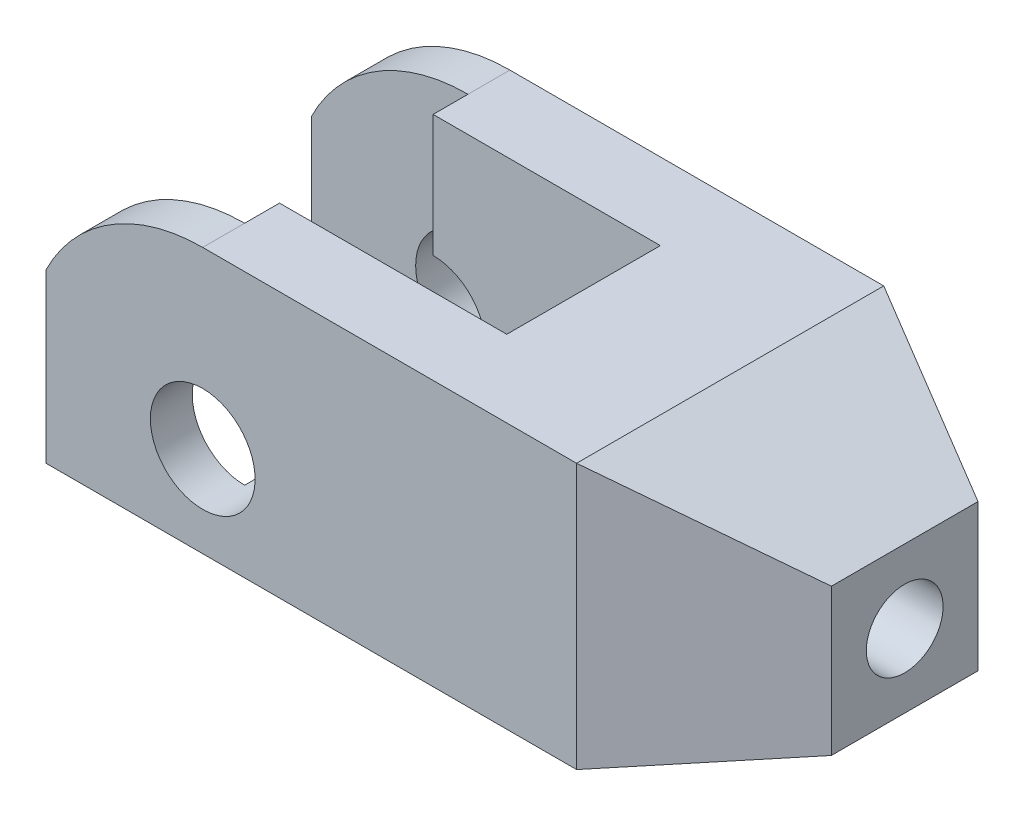
ISO-10303-21;
HEADER;
FILE_DESCRIPTION(('STEP AP214'),'2;1');
FILE_NAME('part.step','',(''),(''),'','','');
FILE_SCHEMA(('AUTOMOTIVE_DESIGN { 1 0 10303 214 1 1 1 1 }'));
ENDSEC;
DATA;
#1=APPLICATION_CONTEXT('core data for automotive mechanical design processes');
#2=APPLICATION_PROTOCOL_DEFINITION('international standard','automotive_design',2000,#1);
#3=PRODUCT_CONTEXT('',#1,'mechanical');
#4=PRODUCT('Part','Part','',(#3));
#5=PRODUCT_RELATED_PRODUCT_CATEGORY('part','',(#4));
#6=PRODUCT_DEFINITION_FORMATION('','',#4);
#7=PRODUCT_DEFINITION_CONTEXT('part definition',#1,'design');
#8=PRODUCT_DEFINITION('design','',#6,#7);
#9=PRODUCT_DEFINITION_SHAPE('','',#8);
#10=(LENGTH_UNIT() NAMED_UNIT(*) SI_UNIT(.MILLI.,.METRE.));
#11=(NAMED_UNIT(*) PLANE_ANGLE_UNIT() SI_UNIT($,.RADIAN.));
#12=(NAMED_UNIT(*) SI_UNIT($,.STERADIAN.) SOLID_ANGLE_UNIT());
#13=UNCERTAINTY_MEASURE_WITH_UNIT(LENGTH_MEASURE(1.E-05),#10,'distance_accuracy_value','');
#14=(GEOMETRIC_REPRESENTATION_CONTEXT(3) GLOBAL_UNCERTAINTY_ASSIGNED_CONTEXT((#13)) GLOBAL_UNIT_ASSIGNED_CONTEXT((#10,
#11,#12)) REPRESENTATION_CONTEXT('',''));
#15=CARTESIAN_POINT('',(0.,0.,0.));
#16=DIRECTION('',(0.,0.,1.));
#17=DIRECTION('',(1.,0.,0.));
#18=AXIS2_PLACEMENT_3D('',#15,#16,#17);
#19=CARTESIAN_POINT('',(0.,38.,0.));
#20=DIRECTION('',(0.,-1.,0.));
#21=DIRECTION('',(0.,0.,-1.));
#22=AXIS2_PLACEMENT_3D('',#19,#20,#21);
#23=PLANE('',#22);
#24=DIRECTION('',(-1.,0.,0.));
#25=VECTOR('',#24,1.);
#26=CARTESIAN_POINT('',(0.,38.,-11.));
#27=LINE('',#26,#25);
#28=CARTESIAN_POINT('',(17.,38.,-11.));
#29=VERTEX_POINT('',#28);
#30=CARTESIAN_POINT('',(-15.5500556793563,38.,-11.));
#31=VERTEX_POINT('',#30);
#32=EDGE_CURVE('E323',#29,#31,#27,.T.);
#33=ORIENTED_EDGE('',*,*,#32,.F.);
#34=DIRECTION('',(0.,0.,-1.));
#35=VECTOR('',#34,1.);
#36=CARTESIAN_POINT('',(17.,38.,0.));
#37=LINE('',#36,#35);
#38=CARTESIAN_POINT('',(17.,38.,11.));
#39=VERTEX_POINT('',#38);
#40=EDGE_CURVE('E307',#39,#29,#37,.T.);
#41=ORIENTED_EDGE('',*,*,#40,.F.);
#42=DIRECTION('',(-1.,0.,0.));
#43=VECTOR('',#42,1.);
#44=CARTESIAN_POINT('',(0.,38.,11.));
#45=LINE('',#44,#43);
#46=CARTESIAN_POINT('',(-15.5500556793563,38.,11.));
#47=VERTEX_POINT('',#46);
#48=EDGE_CURVE('E326',#39,#47,#45,.T.);
#49=ORIENTED_EDGE('',*,*,#48,.T.);
#50=DIRECTION('',(0.,0.,1.));
#51=VECTOR('',#50,1.);
#52=CARTESIAN_POINT('',(-15.5500556793563,38.,-22.));
#53=LINE('',#52,#51);
#54=CARTESIAN_POINT('',(-15.5500556793563,38.,16.));
#55=VERTEX_POINT('',#54);
#56=EDGE_CURVE('E310',#55,#47,#53,.F.);
#57=ORIENTED_EDGE('',*,*,#56,.F.);
#58=DIRECTION('',(0.,0.,1.));
#59=VECTOR('',#58,1.);
#60=CARTESIAN_POINT('',(-15.5500556793563,38.,-22.));
#61=LINE('',#60,#59);
#62=CARTESIAN_POINT('',(-15.5500556793563,38.,22.));
#63=VERTEX_POINT('',#62);
#64=EDGE_CURVE('E299',#55,#63,#61,.T.);
#65=ORIENTED_EDGE('',*,*,#64,.T.);
#66=DIRECTION('',(1.,0.,0.));
#67=VECTOR('',#66,1.);
#68=CARTESIAN_POINT('',(-38.,38.,22.));
#69=LINE('',#68,#67);
#70=CARTESIAN_POINT('',(38.,38.,22.));
#71=VERTEX_POINT('',#70);
#72=EDGE_CURVE('E249',#63,#71,#69,.T.);
#73=ORIENTED_EDGE('',*,*,#72,.T.);
#74=DIRECTION('',(0.,0.,-1.));
#75=VECTOR('',#74,1.);
#76=CARTESIAN_POINT('',(38.,38.,0.));
#77=LINE('',#76,#75);
#78=CARTESIAN_POINT('',(38.,38.,-22.));
#79=VERTEX_POINT('',#78);
#80=EDGE_CURVE('E247',#71,#79,#77,.T.);
#81=ORIENTED_EDGE('',*,*,#80,.T.);
#82=DIRECTION('',(-1.,0.,0.));
#83=VECTOR('',#82,1.);
#84=CARTESIAN_POINT('',(-38.,38.,-22.));
#85=LINE('',#84,#83);
#86=CARTESIAN_POINT('',(-15.5500556793563,38.,-22.));
#87=VERTEX_POINT('',#86);
#88=EDGE_CURVE('E253',#79,#87,#85,.T.);
#89=ORIENTED_EDGE('',*,*,#88,.T.);
#90=CARTESIAN_POINT('',(-15.5500556793563,38.,-16.));
#91=VERTEX_POINT('',#90);
#92=EDGE_CURVE('E294',#87,#91,#61,.T.);
#93=ORIENTED_EDGE('',*,*,#92,.T.);
#94=DIRECTION('',(0.,0.,1.));
#95=VECTOR('',#94,1.);
#96=CARTESIAN_POINT('',(-15.5500556793563,38.,-22.));
#97=LINE('',#96,#95);
#98=EDGE_CURVE('E320',#31,#91,#97,.F.);
#99=ORIENTED_EDGE('',*,*,#98,.F.);
#100=EDGE_LOOP('',(#33,#41,#49,#57,#65,#73,#81,#89,#93,#99));
#101=FACE_BOUND('',#100,.T.);
#102=ADVANCED_FACE('F51',(#101),#23,.F.);
#103=CARTESIAN_POINT('',(-38.,38.,22.));
#104=DIRECTION('',(1.,0.,0.));
#105=DIRECTION('',(0.,0.,-1.));
#106=AXIS2_PLACEMENT_3D('',#103,#104,#105);
#107=PLANE('',#106);
#108=DIRECTION('',(0.,1.,0.));
#109=VECTOR('',#108,1.);
#110=CARTESIAN_POINT('',(-38.,0.,-16.));
#111=LINE('',#110,#109);
#112=CARTESIAN_POINT('',(-38.,0.,-16.));
#113=VERTEX_POINT('',#112);
#114=CARTESIAN_POINT('',(-38.,24.,-16.));
#115=VERTEX_POINT('',#114);
#116=EDGE_CURVE('E346',#113,#115,#111,.T.);
#117=ORIENTED_EDGE('',*,*,#116,.T.);
#118=DIRECTION('',(0.,0.,1.));
#119=VECTOR('',#118,1.);
#120=CARTESIAN_POINT('',(-38.,24.,-22.));
#121=LINE('',#120,#119);
#122=CARTESIAN_POINT('',(-38.,24.,-22.));
#123=VERTEX_POINT('',#122);
#124=EDGE_CURVE('E295',#123,#115,#121,.T.);
#125=ORIENTED_EDGE('',*,*,#124,.F.);
#126=DIRECTION('',(0.,-1.,0.));
#127=VECTOR('',#126,1.);
#128=CARTESIAN_POINT('',(-38.,38.,-22.));
#129=LINE('',#128,#127);
#130=CARTESIAN_POINT('',(-38.,0.,-22.));
#131=VERTEX_POINT('',#130);
#132=EDGE_CURVE('E228',#123,#131,#129,.T.);
#133=ORIENTED_EDGE('',*,*,#132,.T.);
#134=DIRECTION('',(0.,0.,1.));
#135=VECTOR('',#134,1.);
#136=CARTESIAN_POINT('',(-38.,0.,22.));
#137=LINE('',#136,#135);
#138=EDGE_CURVE('E248',#131,#113,#137,.T.);
#139=ORIENTED_EDGE('',*,*,#138,.T.);
#140=EDGE_LOOP('',(#117,#125,#133,#139));
#141=FACE_BOUND('',#140,.T.);
#142=ADVANCED_FACE('F530',(#141),#107,.F.);
#143=CARTESIAN_POINT('',(-15.5500556793563,13.,-22.));
#144=DIRECTION('',(0.,0.,1.));
#145=DIRECTION('',(1.,0.,0.));
#146=AXIS2_PLACEMENT_3D('',#143,#144,#145);
#147=CYLINDRICAL_SURFACE('',#146,25.);
#148=CARTESIAN_POINT('',(-15.5500556793563,13.,-16.));
#149=DIRECTION('',(0.,0.,1.));
#150=DIRECTION('',(1.,0.,0.));
#151=AXIS2_PLACEMENT_3D('',#148,#149,#150);
#152=CIRCLE('',#151,25.);
#153=EDGE_CURVE('E317',#91,#115,#152,.T.);
#154=ORIENTED_EDGE('',*,*,#153,.F.);
#155=ORIENTED_EDGE('',*,*,#92,.F.);
#156=CARTESIAN_POINT('',(-15.5500556793563,13.,-22.));
#157=DIRECTION('',(0.,0.,-1.));
#158=DIRECTION('',(1.,0.,0.));
#159=AXIS2_PLACEMENT_3D('',#156,#157,#158);
#160=CIRCLE('',#159,25.);
#161=EDGE_CURVE('E290',#123,#87,#160,.T.);
#162=ORIENTED_EDGE('',*,*,#161,.F.);
#163=ORIENTED_EDGE('',*,*,#124,.T.);
#164=EDGE_LOOP('',(#154,#155,#162,#163));
#165=FACE_BOUND('',#164,.T.);
#166=ADVANCED_FACE('F536',(#165),#147,.T.);
#167=CARTESIAN_POINT('',(-15.5500556793563,13.,-22.));
#168=DIRECTION('',(0.,0.,1.));
#169=DIRECTION('',(1.,0.,0.));
#170=AXIS2_PLACEMENT_3D('',#167,#168,#169);
#171=CYLINDRICAL_SURFACE('',#170,7.5);
#172=CARTESIAN_POINT('',(-15.5500556793563,13.,-22.));
#173=DIRECTION('',(0.,0.,1.));
#174=DIRECTION('',(1.,0.,0.));
#175=AXIS2_PLACEMENT_3D('',#172,#173,#174);
#176=CIRCLE('',#175,7.5);
#177=CARTESIAN_POINT('',(-8.05005567935635,13.,-22.));
#178=VERTEX_POINT('',#177);
#179=EDGE_CURVE('E280',#178,#178,#176,.T.);
#180=ORIENTED_EDGE('',*,*,#179,.F.);
#181=EDGE_LOOP('',(#180));
#182=FACE_BOUND('',#181,.T.);
#183=CARTESIAN_POINT('',(-15.5500556793563,13.,-16.));
#184=DIRECTION('',(0.,0.,1.));
#185=DIRECTION('',(1.,0.,0.));
#186=AXIS2_PLACEMENT_3D('',#183,#184,#185);
#187=CIRCLE('',#186,7.5);
#188=CARTESIAN_POINT('',(-15.5500556793563,5.5,-16.));
#189=VERTEX_POINT('',#188);
#190=CARTESIAN_POINT('',(-15.5500556793563,20.5,-16.));
#191=VERTEX_POINT('',#190);
#192=EDGE_CURVE('E12',#189,#191,#187,.F.);
#193=ORIENTED_EDGE('',*,*,#192,.F.);
#194=DIRECTION('',(0.,0.,1.));
#195=VECTOR('',#194,1.);
#196=CARTESIAN_POINT('',(-15.5500556793563,5.5,-22.));
#197=LINE('',#196,#195);
#198=CARTESIAN_POINT('',(-15.5500556793563,5.5,-11.));
#199=VERTEX_POINT('',#198);
#200=EDGE_CURVE('E62',#199,#189,#197,.F.);
#201=ORIENTED_EDGE('',*,*,#200,.F.);
#202=CARTESIAN_POINT('',(-15.5500556793563,13.,-11.));
#203=DIRECTION('',(0.,0.,1.));
#204=DIRECTION('',(1.,0.,0.));
#205=AXIS2_PLACEMENT_3D('',#202,#203,#204);
#206=CIRCLE('',#205,7.5);
#207=CARTESIAN_POINT('',(-15.5500556793563,20.5,-11.));
#208=VERTEX_POINT('',#207);
#209=EDGE_CURVE('E236',#208,#199,#206,.F.);
#210=ORIENTED_EDGE('',*,*,#209,.F.);
#211=DIRECTION('',(0.,0.,1.));
#212=VECTOR('',#211,1.);
#213=CARTESIAN_POINT('',(-15.5500556793563,20.5,-22.));
#214=LINE('',#213,#212);
#215=EDGE_CURVE('E239',#191,#208,#214,.T.);
#216=ORIENTED_EDGE('',*,*,#215,.F.);
#217=EDGE_LOOP('',(#193,#201,#210,#216));
#218=FACE_BOUND('',#217,.T.);
#219=ADVANCED_FACE('F554',(#182,#218),#171,.F.);
#220=CARTESIAN_POINT('',(-38.,38.,-22.));
#221=DIRECTION('',(0.,0.,1.));
#222=DIRECTION('',(1.,0.,0.));
#223=AXIS2_PLACEMENT_3D('',#220,#221,#222);
#224=PLANE('',#223);
#225=ORIENTED_EDGE('',*,*,#179,.T.);
#226=EDGE_LOOP('',(#225));
#227=FACE_BOUND('',#226,.T.);
#228=ORIENTED_EDGE('',*,*,#132,.F.);
#229=ORIENTED_EDGE('',*,*,#161,.T.);
#230=ORIENTED_EDGE('',*,*,#88,.F.);
#231=DIRECTION('',(0.,1.,0.));
#232=VECTOR('',#231,1.);
#233=CARTESIAN_POINT('',(38.,38.,-22.));
#234=LINE('',#233,#232);
#235=CARTESIAN_POINT('',(38.,0.,-22.));
#236=VERTEX_POINT('',#235);
#237=EDGE_CURVE('E222',#79,#236,#234,.F.);
#238=ORIENTED_EDGE('',*,*,#237,.T.);
#239=DIRECTION('',(-1.,0.,0.));
#240=VECTOR('',#239,1.);
#241=CARTESIAN_POINT('',(-38.,0.,-22.));
#242=LINE('',#241,#240);
#243=EDGE_CURVE('E257',#236,#131,#242,.T.);
#244=ORIENTED_EDGE('',*,*,#243,.T.);
#245=EDGE_LOOP('',(#228,#229,#230,#238,#244));
#246=FACE_BOUND('',#245,.T.);
#247=ADVANCED_FACE('F53',(#227,#246),#224,.F.);
#248=CARTESIAN_POINT('',(-38.,24.,16.));
#249=VERTEX_POINT('',#248);
#250=CARTESIAN_POINT('',(-38.,24.,22.));
#251=VERTEX_POINT('',#250);
#252=EDGE_CURVE('E300',#249,#251,#121,.T.);
#253=ORIENTED_EDGE('',*,*,#252,.F.);
#254=DIRECTION('',(0.,1.,0.));
#255=VECTOR('',#254,1.);
#256=CARTESIAN_POINT('',(-38.,0.,16.));
#257=LINE('',#256,#255);
#258=CARTESIAN_POINT('',(-38.,0.,16.));
#259=VERTEX_POINT('',#258);
#260=EDGE_CURVE('E350',#259,#249,#257,.T.);
#261=ORIENTED_EDGE('',*,*,#260,.F.);
#262=CARTESIAN_POINT('',(-38.,0.,22.));
#263=VERTEX_POINT('',#262);
#264=EDGE_CURVE('E261',#259,#263,#137,.T.);
#265=ORIENTED_EDGE('',*,*,#264,.T.);
#266=DIRECTION('',(0.,-1.,0.));
#267=VECTOR('',#266,1.);
#268=CARTESIAN_POINT('',(-38.,38.,22.));
#269=LINE('',#268,#267);
#270=EDGE_CURVE('E265',#251,#263,#269,.T.);
#271=ORIENTED_EDGE('',*,*,#270,.F.);
#272=EDGE_LOOP('',(#253,#261,#265,#271));
#273=FACE_BOUND('',#272,.T.);
#274=ADVANCED_FACE('F538',(#273),#107,.F.);
#275=CARTESIAN_POINT('',(-38.,38.,22.));
#276=DIRECTION('',(0.,0.,-1.));
#277=DIRECTION('',(-1.,0.,0.));
#278=AXIS2_PLACEMENT_3D('',#275,#276,#277);
#279=PLANE('',#278);
#280=CARTESIAN_POINT('',(-15.5500556793563,13.,22.));
#281=DIRECTION('',(0.,0.,-1.));
#282=DIRECTION('',(-1.,0.,0.));
#283=AXIS2_PLACEMENT_3D('',#280,#281,#282);
#284=CIRCLE('',#283,7.5);
#285=CARTESIAN_POINT('',(-23.0500556793563,13.,22.));
#286=VERTEX_POINT('',#285);
#287=EDGE_CURVE('E269',#286,#286,#284,.T.);
#288=ORIENTED_EDGE('',*,*,#287,.T.);
#289=EDGE_LOOP('',(#288));
#290=FACE_BOUND('',#289,.T.);
#291=ORIENTED_EDGE('',*,*,#72,.F.);
#292=CARTESIAN_POINT('',(-15.5500556793563,13.,22.));
#293=DIRECTION('',(0.,0.,1.));
#294=DIRECTION('',(1.,0.,0.));
#295=AXIS2_PLACEMENT_3D('',#292,#293,#294);
#296=CIRCLE('',#295,25.);
#297=EDGE_CURVE('E231',#251,#63,#296,.F.);
#298=ORIENTED_EDGE('',*,*,#297,.F.);
#299=ORIENTED_EDGE('',*,*,#270,.T.);
#300=DIRECTION('',(1.,0.,0.));
#301=VECTOR('',#300,1.);
#302=CARTESIAN_POINT('',(-38.,0.,22.));
#303=LINE('',#302,#301);
#304=CARTESIAN_POINT('',(38.,0.,22.));
#305=VERTEX_POINT('',#304);
#306=EDGE_CURVE('E244',#263,#305,#303,.T.);
#307=ORIENTED_EDGE('',*,*,#306,.T.);
#308=DIRECTION('',(0.,1.,0.));
#309=VECTOR('',#308,1.);
#310=CARTESIAN_POINT('',(38.,0.,22.));
#311=LINE('',#310,#309);
#312=EDGE_CURVE('E252',#71,#305,#311,.F.);
#313=ORIENTED_EDGE('',*,*,#312,.F.);
#314=EDGE_LOOP('',(#291,#298,#299,#307,#313));
#315=FACE_BOUND('',#314,.T.);
#316=ADVANCED_FACE('F547',(#290,#315),#279,.F.);
#317=CARTESIAN_POINT('',(0.,0.,0.));
#318=DIRECTION('',(0.,-1.,0.));
#319=DIRECTION('',(0.,0.,-1.));
#320=AXIS2_PLACEMENT_3D('',#317,#318,#319);
#321=PLANE('',#320);
#322=DIRECTION('',(1.,0.,0.));
#323=VECTOR('',#322,1.);
#324=CARTESIAN_POINT('',(0.,0.,16.));
#325=LINE('',#324,#323);
#326=CARTESIAN_POINT('',(-15.5500556793563,0.,16.));
#327=VERTEX_POINT('',#326);
#328=EDGE_CURVE('E356',#259,#327,#325,.T.);
#329=ORIENTED_EDGE('',*,*,#328,.T.);
#330=DIRECTION('',(0.,0.,1.));
#331=VECTOR('',#330,1.);
#332=CARTESIAN_POINT('',(-15.5500556793563,0.,0.));
#333=LINE('',#332,#331);
#334=CARTESIAN_POINT('',(-15.5500556793563,0.,11.));
#335=VERTEX_POINT('',#334);
#336=EDGE_CURVE('E374',#335,#327,#333,.T.);
#337=ORIENTED_EDGE('',*,*,#336,.F.);
#338=DIRECTION('',(1.,0.,0.));
#339=VECTOR('',#338,1.);
#340=CARTESIAN_POINT('',(0.,0.,11.));
#341=LINE('',#340,#339);
#342=CARTESIAN_POINT('',(17.,0.,11.));
#343=VERTEX_POINT('',#342);
#344=EDGE_CURVE('E199',#335,#343,#341,.T.);
#345=ORIENTED_EDGE('',*,*,#344,.T.);
#346=DIRECTION('',(0.,0.,1.));
#347=VECTOR('',#346,1.);
#348=CARTESIAN_POINT('',(17.,0.,0.));
#349=LINE('',#348,#347);
#350=CARTESIAN_POINT('',(17.,0.,-11.));
#351=VERTEX_POINT('',#350);
#352=EDGE_CURVE('E369',#351,#343,#349,.T.);
#353=ORIENTED_EDGE('',*,*,#352,.F.);
#354=DIRECTION('',(1.,0.,0.));
#355=VECTOR('',#354,1.);
#356=CARTESIAN_POINT('',(0.,0.,-11.));
#357=LINE('',#356,#355);
#358=CARTESIAN_POINT('',(-15.5500556793563,0.,-11.));
#359=VERTEX_POINT('',#358);
#360=EDGE_CURVE('E366',#359,#351,#357,.T.);
#361=ORIENTED_EDGE('',*,*,#360,.F.);
#362=DIRECTION('',(0.,0.,1.));
#363=VECTOR('',#362,1.);
#364=CARTESIAN_POINT('',(-15.5500556793563,0.,0.));
#365=LINE('',#364,#363);
#366=CARTESIAN_POINT('',(-15.5500556793563,0.,-16.));
#367=VERTEX_POINT('',#366);
#368=EDGE_CURVE('E363',#367,#359,#365,.T.);
#369=ORIENTED_EDGE('',*,*,#368,.F.);
#370=DIRECTION('',(1.,0.,0.));
#371=VECTOR('',#370,1.);
#372=CARTESIAN_POINT('',(0.,0.,-16.));
#373=LINE('',#372,#371);
#374=EDGE_CURVE('E360',#113,#367,#373,.T.);
#375=ORIENTED_EDGE('',*,*,#374,.F.);
#376=ORIENTED_EDGE('',*,*,#138,.F.);
#377=ORIENTED_EDGE('',*,*,#243,.F.);
#378=DIRECTION('',(0.,0.,1.));
#379=VECTOR('',#378,1.);
#380=CARTESIAN_POINT('',(38.,0.,0.));
#381=LINE('',#380,#379);
#382=EDGE_CURVE('E91',#305,#236,#381,.F.);
#383=ORIENTED_EDGE('',*,*,#382,.F.);
#384=ORIENTED_EDGE('',*,*,#306,.F.);
#385=ORIENTED_EDGE('',*,*,#264,.F.);
#386=EDGE_LOOP('',(#329,#337,#345,#353,#361,#369,#375,#376,#377,#383,#384,#385));
#387=FACE_BOUND('',#386,.T.);
#388=ADVANCED_FACE('F544',(#387),#321,.T.);
#389=ORIENTED_EDGE('',*,*,#64,.F.);
#390=CARTESIAN_POINT('',(-15.5500556793563,13.,16.));
#391=DIRECTION('',(0.,0.,1.));
#392=DIRECTION('',(1.,0.,0.));
#393=AXIS2_PLACEMENT_3D('',#390,#391,#392);
#394=CIRCLE('',#393,25.);
#395=EDGE_CURVE('E313',#55,#249,#394,.T.);
#396=ORIENTED_EDGE('',*,*,#395,.T.);
#397=ORIENTED_EDGE('',*,*,#252,.T.);
#398=ORIENTED_EDGE('',*,*,#297,.T.);
#399=EDGE_LOOP('',(#389,#396,#397,#398));
#400=FACE_BOUND('',#399,.T.);
#401=ADVANCED_FACE('F542',(#400),#147,.T.);
#402=DIRECTION('',(0.,0.,1.));
#403=VECTOR('',#402,1.);
#404=CARTESIAN_POINT('',(-15.5500556793563,5.5,-22.));
#405=LINE('',#404,#403);
#406=CARTESIAN_POINT('',(-15.5500556793563,5.5,16.));
#407=VERTEX_POINT('',#406);
#408=CARTESIAN_POINT('',(-15.5500556793563,5.5,11.));
#409=VERTEX_POINT('',#408);
#410=EDGE_CURVE('E208',#407,#409,#405,.F.);
#411=ORIENTED_EDGE('',*,*,#410,.F.);
#412=CARTESIAN_POINT('',(-15.5500556793563,13.,16.));
#413=DIRECTION('',(0.,0.,1.));
#414=DIRECTION('',(1.,0.,0.));
#415=AXIS2_PLACEMENT_3D('',#412,#413,#414);
#416=CIRCLE('',#415,7.5);
#417=CARTESIAN_POINT('',(-15.5500556793563,20.5,16.));
#418=VERTEX_POINT('',#417);
#419=EDGE_CURVE('E215',#407,#418,#416,.F.);
#420=ORIENTED_EDGE('',*,*,#419,.T.);
#421=DIRECTION('',(0.,0.,1.));
#422=VECTOR('',#421,1.);
#423=CARTESIAN_POINT('',(-15.5500556793563,20.5,-22.));
#424=LINE('',#423,#422);
#425=CARTESIAN_POINT('',(-15.5500556793563,20.5,11.));
#426=VERTEX_POINT('',#425);
#427=EDGE_CURVE('E216',#426,#418,#424,.T.);
#428=ORIENTED_EDGE('',*,*,#427,.F.);
#429=CARTESIAN_POINT('',(-15.5500556793563,13.,11.));
#430=DIRECTION('',(0.,0.,1.));
#431=DIRECTION('',(1.,0.,0.));
#432=AXIS2_PLACEMENT_3D('',#429,#430,#431);
#433=CIRCLE('',#432,7.5);
#434=EDGE_CURVE('E196',#426,#409,#433,.F.);
#435=ORIENTED_EDGE('',*,*,#434,.T.);
#436=EDGE_LOOP('',(#411,#420,#428,#435));
#437=FACE_BOUND('',#436,.T.);
#438=ORIENTED_EDGE('',*,*,#287,.F.);
#439=EDGE_LOOP('',(#438));
#440=FACE_BOUND('',#439,.T.);
#441=ADVANCED_FACE('F219',(#437,#440),#171,.F.);
#442=CARTESIAN_POINT('',(17.,0.,0.));
#443=DIRECTION('',(-1.,0.,0.));
#444=DIRECTION('',(0.,0.,1.));
#445=AXIS2_PLACEMENT_3D('',#442,#443,#444);
#446=PLANE('',#445);
#447=CARTESIAN_POINT('',(17.,19.,0.));
#448=DIRECTION('',(-1.,0.,0.));
#449=DIRECTION('',(0.,0.,1.));
#450=AXIS2_PLACEMENT_3D('',#447,#448,#449);
#451=CIRCLE('',#450,5.5);
#452=CARTESIAN_POINT('',(17.,19.,5.5));
#453=VERTEX_POINT('',#452);
#454=EDGE_CURVE('E510',#453,#453,#451,.T.);
#455=ORIENTED_EDGE('',*,*,#454,.F.);
#456=EDGE_LOOP('',(#455));
#457=FACE_BOUND('',#456,.T.);
#458=ORIENTED_EDGE('',*,*,#40,.T.);
#459=DIRECTION('',(0.,1.,0.));
#460=VECTOR('',#459,1.);
#461=CARTESIAN_POINT('',(17.,0.,-11.));
#462=LINE('',#461,#460);
#463=EDGE_CURVE('E333',#351,#29,#462,.T.);
#464=ORIENTED_EDGE('',*,*,#463,.F.);
#465=ORIENTED_EDGE('',*,*,#352,.T.);
#466=DIRECTION('',(0.,1.,0.));
#467=VECTOR('',#466,1.);
#468=CARTESIAN_POINT('',(17.,0.,11.));
#469=LINE('',#468,#467);
#470=EDGE_CURVE('E203',#343,#39,#469,.T.);
#471=ORIENTED_EDGE('',*,*,#470,.T.);
#472=EDGE_LOOP('',(#458,#464,#465,#471));
#473=FACE_BOUND('',#472,.T.);
#474=ADVANCED_FACE('F576',(#457,#473),#446,.T.);
#475=CARTESIAN_POINT('',(-15.5500556793563,0.,0.));
#476=DIRECTION('',(-1.,0.,0.));
#477=DIRECTION('',(0.,0.,1.));
#478=AXIS2_PLACEMENT_3D('',#475,#476,#477);
#479=PLANE('',#478);
#480=ORIENTED_EDGE('',*,*,#56,.T.);
#481=DIRECTION('',(0.,1.,0.));
#482=VECTOR('',#481,1.);
#483=CARTESIAN_POINT('',(-15.5500556793563,0.,11.));
#484=LINE('',#483,#482);
#485=EDGE_CURVE('E204',#426,#47,#484,.T.);
#486=ORIENTED_EDGE('',*,*,#485,.F.);
#487=ORIENTED_EDGE('',*,*,#427,.T.);
#488=DIRECTION('',(0.,1.,0.));
#489=VECTOR('',#488,1.);
#490=CARTESIAN_POINT('',(-15.5500556793563,0.,16.));
#491=LINE('',#490,#489);
#492=EDGE_CURVE('E353',#418,#55,#491,.T.);
#493=ORIENTED_EDGE('',*,*,#492,.T.);
#494=EDGE_LOOP('',(#480,#486,#487,#493));
#495=FACE_BOUND('',#494,.T.);
#496=ADVANCED_FACE('F587',(#495),#479,.T.);
#497=ORIENTED_EDGE('',*,*,#410,.T.);
#498=EDGE_CURVE('E190',#335,#409,#484,.T.);
#499=ORIENTED_EDGE('',*,*,#498,.F.);
#500=ORIENTED_EDGE('',*,*,#336,.T.);
#501=EDGE_CURVE('E211',#327,#407,#491,.T.);
#502=ORIENTED_EDGE('',*,*,#501,.T.);
#503=EDGE_LOOP('',(#497,#499,#500,#502));
#504=FACE_BOUND('',#503,.T.);
#505=ADVANCED_FACE('F209',(#504),#479,.T.);
#506=CARTESIAN_POINT('',(0.,0.,16.));
#507=DIRECTION('',(0.,0.,1.));
#508=DIRECTION('',(1.,0.,0.));
#509=AXIS2_PLACEMENT_3D('',#506,#507,#508);
#510=PLANE('',#509);
#511=ORIENTED_EDGE('',*,*,#492,.F.);
#512=ORIENTED_EDGE('',*,*,#419,.F.);
#513=ORIENTED_EDGE('',*,*,#501,.F.);
#514=ORIENTED_EDGE('',*,*,#328,.F.);
#515=ORIENTED_EDGE('',*,*,#260,.T.);
#516=ORIENTED_EDGE('',*,*,#395,.F.);
#517=EDGE_LOOP('',(#511,#512,#513,#514,#515,#516));
#518=FACE_BOUND('',#517,.T.);
#519=ADVANCED_FACE('F399',(#518),#510,.F.);
#520=CARTESIAN_POINT('',(0.,0.,-16.));
#521=DIRECTION('',(0.,0.,1.));
#522=DIRECTION('',(1.,0.,0.));
#523=AXIS2_PLACEMENT_3D('',#520,#521,#522);
#524=PLANE('',#523);
#525=ORIENTED_EDGE('',*,*,#153,.T.);
#526=ORIENTED_EDGE('',*,*,#116,.F.);
#527=ORIENTED_EDGE('',*,*,#374,.T.);
#528=DIRECTION('',(0.,1.,0.));
#529=VECTOR('',#528,1.);
#530=CARTESIAN_POINT('',(-15.5500556793563,0.,-16.));
#531=LINE('',#530,#529);
#532=EDGE_CURVE('E342',#367,#189,#531,.T.);
#533=ORIENTED_EDGE('',*,*,#532,.T.);
#534=ORIENTED_EDGE('',*,*,#192,.T.);
#535=EDGE_CURVE('E341',#191,#91,#531,.T.);
#536=ORIENTED_EDGE('',*,*,#535,.T.);
#537=EDGE_LOOP('',(#525,#526,#527,#533,#534,#536));
#538=FACE_BOUND('',#537,.T.);
#539=ADVANCED_FACE('F599',(#538),#524,.T.);
#540=CARTESIAN_POINT('',(-15.5500556793563,0.,0.));
#541=DIRECTION('',(-1.,0.,0.));
#542=DIRECTION('',(0.,0.,1.));
#543=AXIS2_PLACEMENT_3D('',#540,#541,#542);
#544=PLANE('',#543);
#545=ORIENTED_EDGE('',*,*,#98,.T.);
#546=ORIENTED_EDGE('',*,*,#535,.F.);
#547=ORIENTED_EDGE('',*,*,#215,.T.);
#548=DIRECTION('',(0.,1.,0.));
#549=VECTOR('',#548,1.);
#550=CARTESIAN_POINT('',(-15.5500556793563,0.,-11.));
#551=LINE('',#550,#549);
#552=EDGE_CURVE('E71',#208,#31,#551,.T.);
#553=ORIENTED_EDGE('',*,*,#552,.T.);
#554=EDGE_LOOP('',(#545,#546,#547,#553));
#555=FACE_BOUND('',#554,.T.);
#556=ADVANCED_FACE('F596',(#555),#544,.T.);
#557=ORIENTED_EDGE('',*,*,#200,.T.);
#558=ORIENTED_EDGE('',*,*,#532,.F.);
#559=ORIENTED_EDGE('',*,*,#368,.T.);
#560=EDGE_CURVE('E337',#359,#199,#551,.T.);
#561=ORIENTED_EDGE('',*,*,#560,.T.);
#562=EDGE_LOOP('',(#557,#558,#559,#561));
#563=FACE_BOUND('',#562,.T.);
#564=ADVANCED_FACE('F606',(#563),#544,.T.);
#565=CARTESIAN_POINT('',(0.,0.,-11.));
#566=DIRECTION('',(0.,0.,1.));
#567=DIRECTION('',(1.,0.,0.));
#568=AXIS2_PLACEMENT_3D('',#565,#566,#567);
#569=PLANE('',#568);
#570=ORIENTED_EDGE('',*,*,#32,.T.);
#571=ORIENTED_EDGE('',*,*,#552,.F.);
#572=ORIENTED_EDGE('',*,*,#209,.T.);
#573=ORIENTED_EDGE('',*,*,#560,.F.);
#574=ORIENTED_EDGE('',*,*,#360,.T.);
#575=ORIENTED_EDGE('',*,*,#463,.T.);
#576=EDGE_LOOP('',(#570,#571,#572,#573,#574,#575));
#577=FACE_BOUND('',#576,.T.);
#578=ADVANCED_FACE('F579',(#577),#569,.T.);
#579=CARTESIAN_POINT('',(0.,0.,11.));
#580=DIRECTION('',(0.,0.,1.));
#581=DIRECTION('',(1.,0.,0.));
#582=AXIS2_PLACEMENT_3D('',#579,#580,#581);
#583=PLANE('',#582);
#584=ORIENTED_EDGE('',*,*,#470,.F.);
#585=ORIENTED_EDGE('',*,*,#344,.F.);
#586=ORIENTED_EDGE('',*,*,#498,.T.);
#587=ORIENTED_EDGE('',*,*,#434,.F.);
#588=ORIENTED_EDGE('',*,*,#485,.T.);
#589=ORIENTED_EDGE('',*,*,#48,.F.);
#590=EDGE_LOOP('',(#584,#585,#586,#587,#588,#589));
#591=FACE_BOUND('',#590,.T.);
#592=ADVANCED_FACE('F193',(#591),#583,.F.);
#593=CARTESIAN_POINT('',(63.,0.,0.));
#594=DIRECTION('',(-1.,0.,0.));
#595=DIRECTION('',(0.,0.,1.));
#596=AXIS2_PLACEMENT_3D('',#593,#594,#595);
#597=PLANE('',#596);
#598=CARTESIAN_POINT('',(63.,19.,0.));
#599=DIRECTION('',(-1.,0.,0.));
#600=DIRECTION('',(0.,0.,1.));
#601=AXIS2_PLACEMENT_3D('',#598,#599,#600);
#602=CIRCLE('',#601,5.5);
#603=CARTESIAN_POINT('',(63.,19.,5.5));
#604=VERTEX_POINT('',#603);
#605=EDGE_CURVE('E55',#604,#604,#602,.T.);
#606=ORIENTED_EDGE('',*,*,#605,.T.);
#607=EDGE_LOOP('',(#606));
#608=FACE_BOUND('',#607,.T.);
#609=DIRECTION('',(0.,1.,0.));
#610=VECTOR('',#609,1.);
#611=CARTESIAN_POINT('',(63.,8.49999999999999,-10.5));
#612=LINE('',#611,#610);
#613=CARTESIAN_POINT('',(63.,8.49999999999999,-10.5));
#614=VERTEX_POINT('',#613);
#615=CARTESIAN_POINT('',(63.,29.5,-10.5));
#616=VERTEX_POINT('',#615);
#617=EDGE_CURVE('E427',#614,#616,#612,.T.);
#618=ORIENTED_EDGE('',*,*,#617,.T.);
#619=DIRECTION('',(0.,0.,1.));
#620=VECTOR('',#619,1.);
#621=CARTESIAN_POINT('',(63.,29.5,10.5));
#622=LINE('',#621,#620);
#623=CARTESIAN_POINT('',(63.,29.5,10.5));
#624=VERTEX_POINT('',#623);
#625=EDGE_CURVE('E420',#616,#624,#622,.T.);
#626=ORIENTED_EDGE('',*,*,#625,.T.);
#627=DIRECTION('',(0.,-1.,0.));
#628=VECTOR('',#627,1.);
#629=CARTESIAN_POINT('',(63.,8.49999999999999,10.5));
#630=LINE('',#629,#628);
#631=CARTESIAN_POINT('',(63.,8.49999999999999,10.5));
#632=VERTEX_POINT('',#631);
#633=EDGE_CURVE('E100',#624,#632,#630,.T.);
#634=ORIENTED_EDGE('',*,*,#633,.T.);
#635=DIRECTION('',(0.,0.,-1.));
#636=VECTOR('',#635,1.);
#637=CARTESIAN_POINT('',(63.,8.49999999999999,10.5));
#638=LINE('',#637,#636);
#639=EDGE_CURVE('E377',#632,#614,#638,.T.);
#640=ORIENTED_EDGE('',*,*,#639,.T.);
#641=EDGE_LOOP('',(#618,#626,#634,#640));
#642=FACE_BOUND('',#641,.T.);
#643=ADVANCED_FACE('F384',(#608,#642),#597,.F.);
#644=CARTESIAN_POINT('',(14.9891053152856,0.,32.5850115549686));
#645=DIRECTION('',(-0.417905608232144,0.,-0.908490452678575));
#646=DIRECTION('',(-0.908490452678575,0.,0.417905608232144));
#647=AXIS2_PLACEMENT_3D('',#644,#645,#646);
#648=PLANE('',#647);
#649=DIRECTION('',(0.868024160573518,0.295128214594996,-0.399291113863818));
#650=VECTOR('',#649,1.);
#651=CARTESIAN_POINT('',(38.,0.,22.));
#652=LINE('',#651,#650);
#653=EDGE_CURVE('E458',#305,#632,#652,.T.);
#654=ORIENTED_EDGE('',*,*,#653,.T.);
#655=ORIENTED_EDGE('',*,*,#633,.F.);
#656=DIRECTION('',(0.868024160573518,-0.295128214594996,-0.399291113863818));
#657=VECTOR('',#656,1.);
#658=CARTESIAN_POINT('',(38.,38.,22.));
#659=LINE('',#658,#657);
#660=EDGE_CURVE('E453',#71,#624,#659,.T.);
#661=ORIENTED_EDGE('',*,*,#660,.F.);
#662=ORIENTED_EDGE('',*,*,#312,.T.);
#663=EDGE_LOOP('',(#654,#655,#661,#662));
#664=FACE_BOUND('',#663,.T.);
#665=ADVANCED_FACE('F394',(#664),#648,.F.);
#666=CARTESIAN_POINT('',(15.518823951237,45.6435998565794,0.));
#667=DIRECTION('',(-0.321902733238702,-0.946772744819713,0.));
#668=DIRECTION('',(0.946772744819713,-0.321902733238702,0.));
#669=AXIS2_PLACEMENT_3D('',#666,#667,#668);
#670=PLANE('',#669);
#671=ORIENTED_EDGE('',*,*,#660,.T.);
#672=ORIENTED_EDGE('',*,*,#625,.F.);
#673=DIRECTION('',(0.868024160573518,-0.295128214594996,0.399291113863818));
#674=VECTOR('',#673,1.);
#675=CARTESIAN_POINT('',(38.,38.,-22.));
#676=LINE('',#675,#674);
#677=EDGE_CURVE('E447',#79,#616,#676,.T.);
#678=ORIENTED_EDGE('',*,*,#677,.F.);
#679=ORIENTED_EDGE('',*,*,#80,.F.);
#680=EDGE_LOOP('',(#671,#672,#678,#679));
#681=FACE_BOUND('',#680,.T.);
#682=ADVANCED_FACE('F475',(#681),#670,.F.);
#683=CARTESIAN_POINT('',(3.93761204732879,-11.5812119039082,0.));
#684=DIRECTION('',(-0.321902733238702,0.946772744819713,0.));
#685=DIRECTION('',(-0.946772744819713,-0.321902733238702,0.));
#686=AXIS2_PLACEMENT_3D('',#683,#684,#685);
#687=PLANE('',#686);
#688=DIRECTION('',(0.868024160573518,0.295128214594996,0.399291113863818));
#689=VECTOR('',#688,1.);
#690=CARTESIAN_POINT('',(38.,0.,-22.));
#691=LINE('',#690,#689);
#692=EDGE_CURVE('E445',#236,#614,#691,.T.);
#693=ORIENTED_EDGE('',*,*,#692,.T.);
#694=ORIENTED_EDGE('',*,*,#639,.F.);
#695=ORIENTED_EDGE('',*,*,#653,.F.);
#696=ORIENTED_EDGE('',*,*,#382,.T.);
#697=EDGE_LOOP('',(#693,#694,#695,#696));
#698=FACE_BOUND('',#697,.T.);
#699=ADVANCED_FACE('F451',(#698),#687,.F.);
#700=CARTESIAN_POINT('',(14.9891053152856,0.,-32.5850115549686));
#701=DIRECTION('',(-0.417905608232144,0.,0.908490452678575));
#702=DIRECTION('',(0.908490452678575,0.,0.417905608232144));
#703=AXIS2_PLACEMENT_3D('',#700,#701,#702);
#704=PLANE('',#703);
#705=ORIENTED_EDGE('',*,*,#677,.T.);
#706=ORIENTED_EDGE('',*,*,#617,.F.);
#707=ORIENTED_EDGE('',*,*,#692,.F.);
#708=ORIENTED_EDGE('',*,*,#237,.F.);
#709=EDGE_LOOP('',(#705,#706,#707,#708));
#710=FACE_BOUND('',#709,.T.);
#711=ADVANCED_FACE('F396',(#710),#704,.F.);
#712=CARTESIAN_POINT('',(-38.,19.,0.));
#713=DIRECTION('',(1.,0.,0.));
#714=DIRECTION('',(0.,0.,-1.));
#715=AXIS2_PLACEMENT_3D('',#712,#713,#714);
#716=CYLINDRICAL_SURFACE('',#715,5.5);
#717=ORIENTED_EDGE('',*,*,#454,.T.);
#718=EDGE_LOOP('',(#717));
#719=FACE_BOUND('',#718,.T.);
#720=ORIENTED_EDGE('',*,*,#605,.F.);
#721=EDGE_LOOP('',(#720));
#722=FACE_BOUND('',#721,.T.);
#723=ADVANCED_FACE('F524',(#719,#722),#716,.F.);
#724=CLOSED_SHELL('',(#102,#142,#166,#219,#247,#274,#316,#388,#401,#441,#474,#496,#505,#519,
#539,#556,#564,#578,#592,#643,#665,#682,#699,#711,#723));
#725=MANIFOLD_SOLID_BREP('B2',#724);
#726=ADVANCED_BREP_SHAPE_REPRESENTATION('',(#18,#725),#14);
#727=SHAPE_DEFINITION_REPRESENTATION(#9,#726);
ENDSEC;
END-ISO-10303-21;
